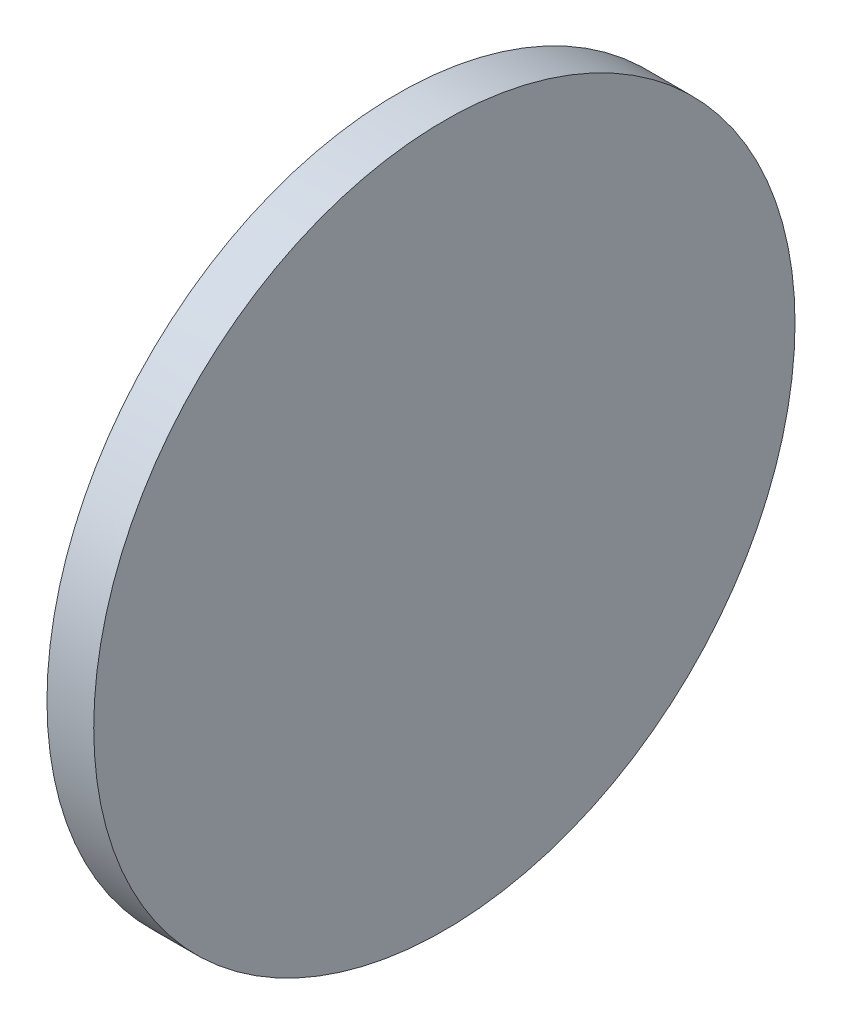
ISO-10303-21;
HEADER;
FILE_DESCRIPTION(('STEP AP214'),'2;1');
FILE_NAME('part.step','',(''),(''),'','','');
FILE_SCHEMA(('AUTOMOTIVE_DESIGN { 1 0 10303 214 1 1 1 1 }'));
ENDSEC;
DATA;
#1=APPLICATION_CONTEXT('core data for automotive mechanical design processes');
#2=APPLICATION_PROTOCOL_DEFINITION('international standard','automotive_design',2000,#1);
#3=PRODUCT_CONTEXT('',#1,'mechanical');
#4=PRODUCT('Part','Part','',(#3));
#5=PRODUCT_RELATED_PRODUCT_CATEGORY('part','',(#4));
#6=PRODUCT_DEFINITION_FORMATION('','',#4);
#7=PRODUCT_DEFINITION_CONTEXT('part definition',#1,'design');
#8=PRODUCT_DEFINITION('design','',#6,#7);
#9=PRODUCT_DEFINITION_SHAPE('','',#8);
#10=(LENGTH_UNIT() NAMED_UNIT(*) SI_UNIT(.MILLI.,.METRE.));
#11=(NAMED_UNIT(*) PLANE_ANGLE_UNIT() SI_UNIT($,.RADIAN.));
#12=(NAMED_UNIT(*) SI_UNIT($,.STERADIAN.) SOLID_ANGLE_UNIT());
#13=UNCERTAINTY_MEASURE_WITH_UNIT(LENGTH_MEASURE(1.E-05),#10,'distance_accuracy_value','');
#14=(GEOMETRIC_REPRESENTATION_CONTEXT(3) GLOBAL_UNCERTAINTY_ASSIGNED_CONTEXT((#13)) GLOBAL_UNIT_ASSIGNED_CONTEXT((#10,
#11,#12)) REPRESENTATION_CONTEXT('',''));
#15=CARTESIAN_POINT('',(0.,0.,0.));
#16=DIRECTION('',(0.,0.,1.));
#17=DIRECTION('',(1.,0.,0.));
#18=AXIS2_PLACEMENT_3D('',#15,#16,#17);
#19=CARTESIAN_POINT('',(260.116303666167,77.2931793490154,0.));
#20=DIRECTION('',(1.,0.,0.));
#21=DIRECTION('',(0.,0.,-1.));
#22=AXIS2_PLACEMENT_3D('',#19,#20,#21);
#23=PLANE('',#22);
#24=CARTESIAN_POINT('',(260.116303666167,77.2931793490154,0.));
#25=DIRECTION('',(-1.,0.,0.));
#26=DIRECTION('',(0.,0.,1.));
#27=AXIS2_PLACEMENT_3D('',#24,#25,#26);
#28=CIRCLE('',#27,15.);
#29=CARTESIAN_POINT('',(260.116303666167,77.2931793490154,15.));
#30=VERTEX_POINT('',#29);
#31=EDGE_CURVE('E10',#30,#30,#28,.T.);
#32=ORIENTED_EDGE('',*,*,#31,.T.);
#33=EDGE_LOOP('',(#32));
#34=FACE_BOUND('',#33,.T.);
#35=ADVANCED_FACE('F35',(#34),#23,.F.);
#36=CARTESIAN_POINT('',(254.000801992616,77.2931793490154,0.));
#37=DIRECTION('',(-1.,0.,0.));
#38=DIRECTION('',(0.,0.,1.));
#39=AXIS2_PLACEMENT_3D('',#36,#37,#38);
#40=CYLINDRICAL_SURFACE('',#39,15.);
#41=ORIENTED_EDGE('',*,*,#31,.F.);
#42=EDGE_LOOP('',(#41));
#43=FACE_BOUND('',#42,.T.);
#44=CARTESIAN_POINT('',(262.116303666167,77.2931793490154,0.));
#45=DIRECTION('',(-1.,0.,0.));
#46=DIRECTION('',(0.,0.,1.));
#47=AXIS2_PLACEMENT_3D('',#44,#45,#46);
#48=CIRCLE('',#47,15.);
#49=CARTESIAN_POINT('',(262.116303666167,77.2931793490154,15.));
#50=VERTEX_POINT('',#49);
#51=EDGE_CURVE('E41',#50,#50,#48,.T.);
#52=ORIENTED_EDGE('',*,*,#51,.T.);
#53=EDGE_LOOP('',(#52));
#54=FACE_BOUND('',#53,.T.);
#55=ADVANCED_FACE('F47',(#43,#54),#40,.T.);
#56=CARTESIAN_POINT('',(262.116303666167,92.2931793490154,0.));
#57=DIRECTION('',(-1.,0.,0.));
#58=DIRECTION('',(0.,0.,1.));
#59=AXIS2_PLACEMENT_3D('',#56,#57,#58);
#60=PLANE('',#59);
#61=ORIENTED_EDGE('',*,*,#51,.F.);
#62=EDGE_LOOP('',(#61));
#63=FACE_BOUND('',#62,.T.);
#64=ADVANCED_FACE('F49',(#63),#60,.F.);
#65=CLOSED_SHELL('',(#35,#55,#64));
#66=MANIFOLD_SOLID_BREP('B2',#65);
#67=ADVANCED_BREP_SHAPE_REPRESENTATION('',(#18,#66),#14);
#68=SHAPE_DEFINITION_REPRESENTATION(#9,#67);
ENDSEC;
END-ISO-10303-21;
